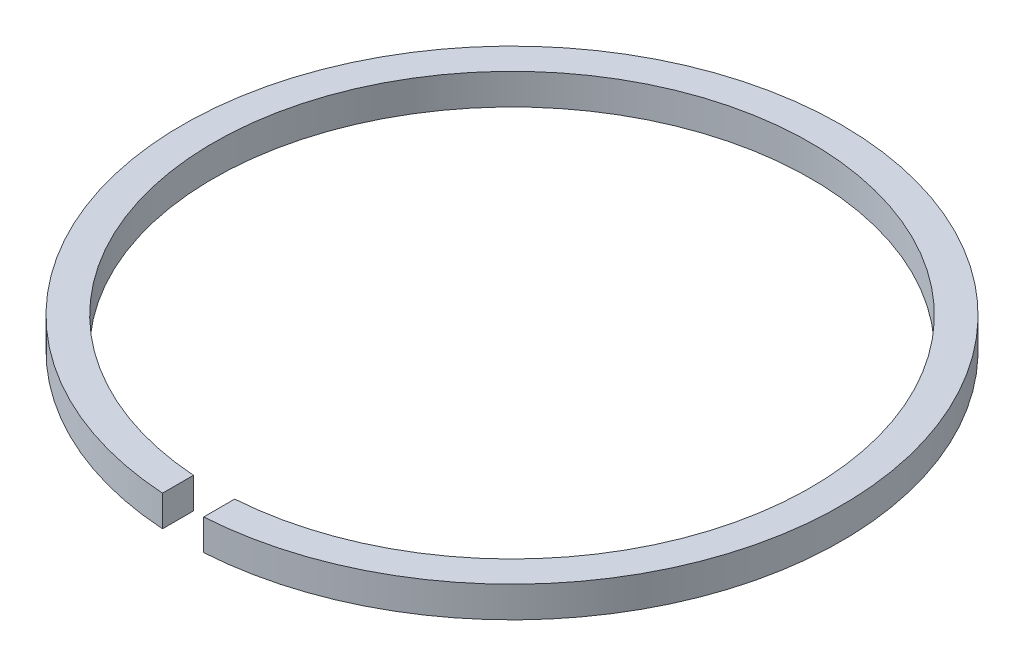
ISO-10303-21;
HEADER;
FILE_DESCRIPTION(('STEP AP214'),'2;1');
FILE_NAME('part.step','',(''),(''),'','','');
FILE_SCHEMA(('AUTOMOTIVE_DESIGN { 1 0 10303 214 1 1 1 1 }'));
ENDSEC;
DATA;
#1=APPLICATION_CONTEXT('core data for automotive mechanical design processes');
#2=APPLICATION_PROTOCOL_DEFINITION('international standard','automotive_design',2000,#1);
#3=PRODUCT_CONTEXT('',#1,'mechanical');
#4=PRODUCT('Part','Part','',(#3));
#5=PRODUCT_RELATED_PRODUCT_CATEGORY('part','',(#4));
#6=PRODUCT_DEFINITION_FORMATION('','',#4);
#7=PRODUCT_DEFINITION_CONTEXT('part definition',#1,'design');
#8=PRODUCT_DEFINITION('design','',#6,#7);
#9=PRODUCT_DEFINITION_SHAPE('','',#8);
#10=(LENGTH_UNIT() NAMED_UNIT(*) SI_UNIT(.MILLI.,.METRE.));
#11=(NAMED_UNIT(*) PLANE_ANGLE_UNIT() SI_UNIT($,.RADIAN.));
#12=(NAMED_UNIT(*) SI_UNIT($,.STERADIAN.) SOLID_ANGLE_UNIT());
#13=UNCERTAINTY_MEASURE_WITH_UNIT(LENGTH_MEASURE(1.E-05),#10,'distance_accuracy_value','');
#14=(GEOMETRIC_REPRESENTATION_CONTEXT(3) GLOBAL_UNCERTAINTY_ASSIGNED_CONTEXT((#13)) GLOBAL_UNIT_ASSIGNED_CONTEXT((#10,
#11,#12)) REPRESENTATION_CONTEXT('',''));
#15=CARTESIAN_POINT('',(0.,0.,0.));
#16=DIRECTION('',(0.,0.,1.));
#17=DIRECTION('',(1.,0.,0.));
#18=AXIS2_PLACEMENT_3D('',#15,#16,#17);
#19=CARTESIAN_POINT('',(0.,0.75,0.));
#20=DIRECTION('',(0.,-1.,0.));
#21=DIRECTION('',(0.,0.,-1.));
#22=AXIS2_PLACEMENT_3D('',#19,#20,#21);
#23=CYLINDRICAL_SURFACE('',#22,14.5);
#24=CARTESIAN_POINT('',(0.,-0.75,0.));
#25=DIRECTION('',(0.,-1.,0.));
#26=DIRECTION('',(0.,0.,1.));
#27=AXIS2_PLACEMENT_3D('',#24,#25,#26);
#28=CIRCLE('',#27,14.5);
#29=CARTESIAN_POINT('',(-0.999999999999998,-0.75,14.4654761414894));
#30=VERTEX_POINT('',#29);
#31=CARTESIAN_POINT('',(1.,-0.75,14.4654761414894));
#32=VERTEX_POINT('',#31);
#33=EDGE_CURVE('E115',#30,#32,#28,.T.);
#34=ORIENTED_EDGE('',*,*,#33,.T.);
#35=DIRECTION('',(0.,-1.,0.));
#36=VECTOR('',#35,1.);
#37=CARTESIAN_POINT('',(1.,0.75,14.4654761414894));
#38=LINE('',#37,#36);
#39=CARTESIAN_POINT('',(1.,0.75,14.4654761414894));
#40=VERTEX_POINT('',#39);
#41=EDGE_CURVE('E11',#40,#32,#38,.T.);
#42=ORIENTED_EDGE('',*,*,#41,.F.);
#43=CARTESIAN_POINT('',(0.,0.75,0.));
#44=DIRECTION('',(0.,-1.,0.));
#45=DIRECTION('',(0.,0.,1.));
#46=AXIS2_PLACEMENT_3D('',#43,#44,#45);
#47=CIRCLE('',#46,14.5);
#48=CARTESIAN_POINT('',(-0.999999999999998,0.75,14.4654761414894));
#49=VERTEX_POINT('',#48);
#50=EDGE_CURVE('E97',#49,#40,#47,.T.);
#51=ORIENTED_EDGE('',*,*,#50,.F.);
#52=DIRECTION('',(0.,-1.,0.));
#53=VECTOR('',#52,1.);
#54=CARTESIAN_POINT('',(-0.999999999999998,0.75,14.4654761414894));
#55=LINE('',#54,#53);
#56=EDGE_CURVE('E111',#49,#30,#55,.T.);
#57=ORIENTED_EDGE('',*,*,#56,.T.);
#58=EDGE_LOOP('',(#34,#42,#51,#57));
#59=FACE_BOUND('',#58,.T.);
#60=ADVANCED_FACE('F45',(#59),#23,.F.);
#61=CARTESIAN_POINT('',(1.,0.75,14.4654761414894));
#62=DIRECTION('',(1.,0.,0.));
#63=DIRECTION('',(0.,0.,-1.));
#64=AXIS2_PLACEMENT_3D('',#61,#62,#63);
#65=PLANE('',#64);
#66=DIRECTION('',(0.,0.,1.));
#67=VECTOR('',#66,1.);
#68=CARTESIAN_POINT('',(1.,-0.75,14.4654761414894));
#69=LINE('',#68,#67);
#70=CARTESIAN_POINT('',(1.,-0.75,15.9687194226713));
#71=VERTEX_POINT('',#70);
#72=EDGE_CURVE('E102',#32,#71,#69,.T.);
#73=ORIENTED_EDGE('',*,*,#72,.T.);
#74=DIRECTION('',(0.,-1.,0.));
#75=VECTOR('',#74,1.);
#76=CARTESIAN_POINT('',(1.,0.75,15.9687194226713));
#77=LINE('',#76,#75);
#78=CARTESIAN_POINT('',(1.,0.75,15.9687194226713));
#79=VERTEX_POINT('',#78);
#80=EDGE_CURVE('E54',#79,#71,#77,.T.);
#81=ORIENTED_EDGE('',*,*,#80,.F.);
#82=DIRECTION('',(0.,0.,1.));
#83=VECTOR('',#82,1.);
#84=CARTESIAN_POINT('',(1.,0.75,14.4654761414894));
#85=LINE('',#84,#83);
#86=EDGE_CURVE('E92',#40,#79,#85,.T.);
#87=ORIENTED_EDGE('',*,*,#86,.F.);
#88=ORIENTED_EDGE('',*,*,#41,.T.);
#89=EDGE_LOOP('',(#73,#81,#87,#88));
#90=FACE_BOUND('',#89,.T.);
#91=ADVANCED_FACE('F101',(#90),#65,.F.);
#92=CARTESIAN_POINT('',(0.,0.75,0.));
#93=DIRECTION('',(0.,-1.,0.));
#94=DIRECTION('',(0.,0.,-1.));
#95=AXIS2_PLACEMENT_3D('',#92,#93,#94);
#96=CYLINDRICAL_SURFACE('',#95,16.);
#97=CARTESIAN_POINT('',(0.,-0.75,0.));
#98=DIRECTION('',(0.,1.,0.));
#99=DIRECTION('',(0.,0.,1.));
#100=AXIS2_PLACEMENT_3D('',#97,#98,#99);
#101=CIRCLE('',#100,16.);
#102=CARTESIAN_POINT('',(-0.999999999999998,-0.75,15.9687194226713));
#103=VERTEX_POINT('',#102);
#104=EDGE_CURVE('E79',#71,#103,#101,.T.);
#105=ORIENTED_EDGE('',*,*,#104,.T.);
#106=DIRECTION('',(0.,-1.,0.));
#107=VECTOR('',#106,1.);
#108=CARTESIAN_POINT('',(-0.999999999999998,0.75,15.9687194226713));
#109=LINE('',#108,#107);
#110=CARTESIAN_POINT('',(-0.999999999999998,0.75,15.9687194226713));
#111=VERTEX_POINT('',#110);
#112=EDGE_CURVE('E104',#111,#103,#109,.T.);
#113=ORIENTED_EDGE('',*,*,#112,.F.);
#114=CARTESIAN_POINT('',(0.,0.75,0.));
#115=DIRECTION('',(0.,1.,0.));
#116=DIRECTION('',(0.,0.,1.));
#117=AXIS2_PLACEMENT_3D('',#114,#115,#116);
#118=CIRCLE('',#117,16.);
#119=EDGE_CURVE('E95',#79,#111,#118,.T.);
#120=ORIENTED_EDGE('',*,*,#119,.F.);
#121=ORIENTED_EDGE('',*,*,#80,.T.);
#122=EDGE_LOOP('',(#105,#113,#120,#121));
#123=FACE_BOUND('',#122,.T.);
#124=ADVANCED_FACE('F105',(#123),#96,.T.);
#125=CARTESIAN_POINT('',(-0.999999999999998,0.75,14.4654761414894));
#126=DIRECTION('',(-1.,0.,0.));
#127=DIRECTION('',(0.,0.,1.));
#128=AXIS2_PLACEMENT_3D('',#125,#126,#127);
#129=PLANE('',#128);
#130=DIRECTION('',(0.,0.,-1.));
#131=VECTOR('',#130,1.);
#132=CARTESIAN_POINT('',(-0.999999999999998,-0.75,14.4654761414894));
#133=LINE('',#132,#131);
#134=EDGE_CURVE('E85',#103,#30,#133,.T.);
#135=ORIENTED_EDGE('',*,*,#134,.T.);
#136=ORIENTED_EDGE('',*,*,#56,.F.);
#137=DIRECTION('',(0.,0.,-1.));
#138=VECTOR('',#137,1.);
#139=CARTESIAN_POINT('',(-0.999999999999998,0.75,14.4654761414894));
#140=LINE('',#139,#138);
#141=EDGE_CURVE('E62',#111,#49,#140,.T.);
#142=ORIENTED_EDGE('',*,*,#141,.F.);
#143=ORIENTED_EDGE('',*,*,#112,.T.);
#144=EDGE_LOOP('',(#135,#136,#142,#143));
#145=FACE_BOUND('',#144,.T.);
#146=ADVANCED_FACE('F130',(#145),#129,.F.);
#147=CARTESIAN_POINT('',(0.,0.75,0.));
#148=DIRECTION('',(0.,1.,0.));
#149=DIRECTION('',(0.,0.,1.));
#150=AXIS2_PLACEMENT_3D('',#147,#148,#149);
#151=PLANE('',#150);
#152=ORIENTED_EDGE('',*,*,#50,.T.);
#153=ORIENTED_EDGE('',*,*,#86,.T.);
#154=ORIENTED_EDGE('',*,*,#119,.T.);
#155=ORIENTED_EDGE('',*,*,#141,.T.);
#156=EDGE_LOOP('',(#152,#153,#154,#155));
#157=FACE_BOUND('',#156,.T.);
#158=ADVANCED_FACE('F93',(#157),#151,.T.);
#159=CARTESIAN_POINT('',(0.,-0.75,0.));
#160=DIRECTION('',(0.,1.,0.));
#161=DIRECTION('',(0.,0.,1.));
#162=AXIS2_PLACEMENT_3D('',#159,#160,#161);
#163=PLANE('',#162);
#164=ORIENTED_EDGE('',*,*,#33,.F.);
#165=ORIENTED_EDGE('',*,*,#134,.F.);
#166=ORIENTED_EDGE('',*,*,#104,.F.);
#167=ORIENTED_EDGE('',*,*,#72,.F.);
#168=EDGE_LOOP('',(#164,#165,#166,#167));
#169=FACE_BOUND('',#168,.T.);
#170=ADVANCED_FACE('F133',(#169),#163,.F.);
#171=CLOSED_SHELL('',(#60,#91,#124,#146,#158,#170));
#172=MANIFOLD_SOLID_BREP('B2',#171);
#173=ADVANCED_BREP_SHAPE_REPRESENTATION('',(#18,#172),#14);
#174=SHAPE_DEFINITION_REPRESENTATION(#9,#173);
ENDSEC;
END-ISO-10303-21;
